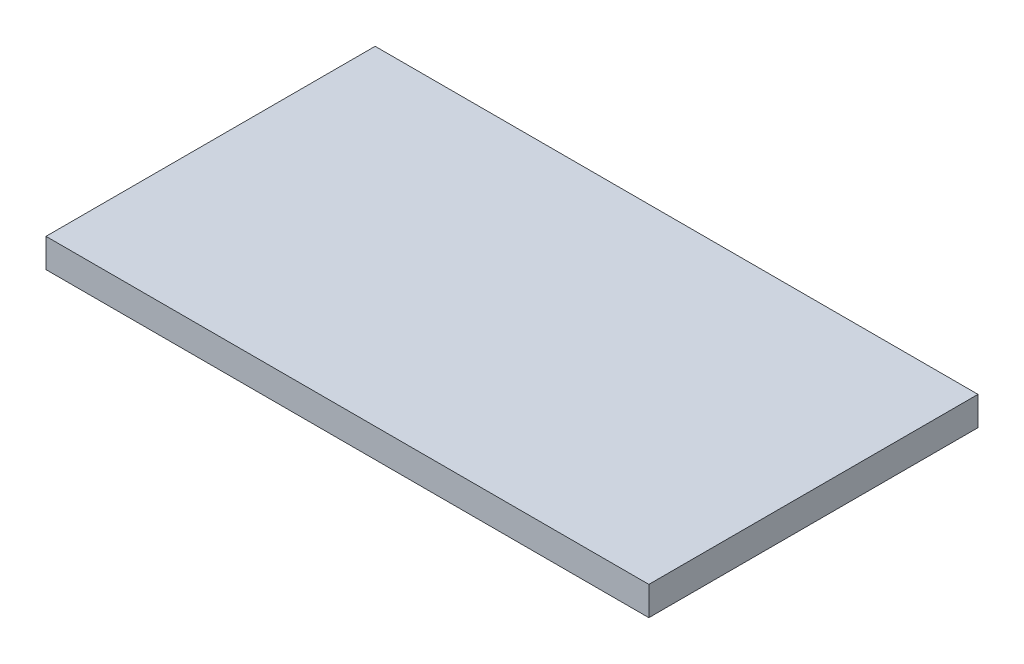
ISO-10303-21;
HEADER;
FILE_DESCRIPTION(('STEP AP214'),'2;1');
FILE_NAME('part.step','',(''),(''),'','','');
FILE_SCHEMA(('AUTOMOTIVE_DESIGN { 1 0 10303 214 1 1 1 1 }'));
ENDSEC;
DATA;
#1=APPLICATION_CONTEXT('core data for automotive mechanical design processes');
#2=APPLICATION_PROTOCOL_DEFINITION('international standard','automotive_design',2000,#1);
#3=PRODUCT_CONTEXT('',#1,'mechanical');
#4=PRODUCT('Part','Part','',(#3));
#5=PRODUCT_RELATED_PRODUCT_CATEGORY('part','',(#4));
#6=PRODUCT_DEFINITION_FORMATION('','',#4);
#7=PRODUCT_DEFINITION_CONTEXT('part definition',#1,'design');
#8=PRODUCT_DEFINITION('design','',#6,#7);
#9=PRODUCT_DEFINITION_SHAPE('','',#8);
#10=(LENGTH_UNIT() NAMED_UNIT(*) SI_UNIT(.MILLI.,.METRE.));
#11=(NAMED_UNIT(*) PLANE_ANGLE_UNIT() SI_UNIT($,.RADIAN.));
#12=(NAMED_UNIT(*) SI_UNIT($,.STERADIAN.) SOLID_ANGLE_UNIT());
#13=UNCERTAINTY_MEASURE_WITH_UNIT(LENGTH_MEASURE(1.E-05),#10,'distance_accuracy_value','');
#14=(GEOMETRIC_REPRESENTATION_CONTEXT(3) GLOBAL_UNCERTAINTY_ASSIGNED_CONTEXT((#13)) GLOBAL_UNIT_ASSIGNED_CONTEXT((#10,
#11,#12)) REPRESENTATION_CONTEXT('',''));
#15=CARTESIAN_POINT('',(0.,0.,0.));
#16=DIRECTION('',(0.,0.,1.));
#17=DIRECTION('',(1.,0.,0.));
#18=AXIS2_PLACEMENT_3D('',#15,#16,#17);
#19=CARTESIAN_POINT('',(0.,2.5,0.));
#20=DIRECTION('',(0.,-1.,0.));
#21=DIRECTION('',(0.,0.,-1.));
#22=AXIS2_PLACEMENT_3D('',#19,#20,#21);
#23=PLANE('',#22);
#24=DIRECTION('',(0.,0.,-1.));
#25=VECTOR('',#24,1.);
#26=CARTESIAN_POINT('',(26.1,2.5,11.7));
#27=LINE('',#26,#25);
#28=CARTESIAN_POINT('',(26.1,2.5,11.7));
#29=VERTEX_POINT('',#28);
#30=CARTESIAN_POINT('',(26.1,2.5,-16.8));
#31=VERTEX_POINT('',#30);
#32=EDGE_CURVE('E86',#29,#31,#27,.T.);
#33=ORIENTED_EDGE('',*,*,#32,.T.);
#34=DIRECTION('',(-1.,0.,0.));
#35=VECTOR('',#34,1.);
#36=CARTESIAN_POINT('',(-26.1,2.5,-16.8));
#37=LINE('',#36,#35);
#38=CARTESIAN_POINT('',(-26.1,2.5,-16.8));
#39=VERTEX_POINT('',#38);
#40=EDGE_CURVE('E82',#31,#39,#37,.T.);
#41=ORIENTED_EDGE('',*,*,#40,.T.);
#42=DIRECTION('',(0.,0.,1.));
#43=VECTOR('',#42,1.);
#44=CARTESIAN_POINT('',(-26.1,2.5,11.7));
#45=LINE('',#44,#43);
#46=CARTESIAN_POINT('',(-26.1,2.5,11.7));
#47=VERTEX_POINT('',#46);
#48=EDGE_CURVE('E84',#39,#47,#45,.T.);
#49=ORIENTED_EDGE('',*,*,#48,.T.);
#50=DIRECTION('',(1.,0.,0.));
#51=VECTOR('',#50,1.);
#52=CARTESIAN_POINT('',(-26.1,2.5,11.7));
#53=LINE('',#52,#51);
#54=EDGE_CURVE('E52',#47,#29,#53,.T.);
#55=ORIENTED_EDGE('',*,*,#54,.T.);
#56=EDGE_LOOP('',(#33,#41,#49,#55));
#57=FACE_BOUND('',#56,.T.);
#58=ADVANCED_FACE('F35',(#57),#23,.F.);
#59=CARTESIAN_POINT('',(0.,0.,0.));
#60=DIRECTION('',(0.,-1.,0.));
#61=DIRECTION('',(0.,0.,-1.));
#62=AXIS2_PLACEMENT_3D('',#59,#60,#61);
#63=PLANE('',#62);
#64=DIRECTION('',(0.,0.,-1.));
#65=VECTOR('',#64,1.);
#66=CARTESIAN_POINT('',(26.1,0.,11.7));
#67=LINE('',#66,#65);
#68=CARTESIAN_POINT('',(26.1,0.,11.7));
#69=VERTEX_POINT('',#68);
#70=CARTESIAN_POINT('',(26.1,0.,-16.8));
#71=VERTEX_POINT('',#70);
#72=EDGE_CURVE('E98',#69,#71,#67,.T.);
#73=ORIENTED_EDGE('',*,*,#72,.F.);
#74=DIRECTION('',(1.,0.,0.));
#75=VECTOR('',#74,1.);
#76=CARTESIAN_POINT('',(-26.1,0.,11.7));
#77=LINE('',#76,#75);
#78=CARTESIAN_POINT('',(-26.1,0.,11.7));
#79=VERTEX_POINT('',#78);
#80=EDGE_CURVE('E75',#79,#69,#77,.T.);
#81=ORIENTED_EDGE('',*,*,#80,.F.);
#82=DIRECTION('',(0.,0.,1.));
#83=VECTOR('',#82,1.);
#84=CARTESIAN_POINT('',(-26.1,0.,11.7));
#85=LINE('',#84,#83);
#86=CARTESIAN_POINT('',(-26.1,0.,-16.8));
#87=VERTEX_POINT('',#86);
#88=EDGE_CURVE('E69',#87,#79,#85,.T.);
#89=ORIENTED_EDGE('',*,*,#88,.F.);
#90=DIRECTION('',(-1.,0.,0.));
#91=VECTOR('',#90,1.);
#92=CARTESIAN_POINT('',(-26.1,0.,-16.8));
#93=LINE('',#92,#91);
#94=EDGE_CURVE('E90',#71,#87,#93,.T.);
#95=ORIENTED_EDGE('',*,*,#94,.F.);
#96=EDGE_LOOP('',(#73,#81,#89,#95));
#97=FACE_BOUND('',#96,.T.);
#98=ADVANCED_FACE('F108',(#97),#63,.T.);
#99=CARTESIAN_POINT('',(26.1,2.5,11.7));
#100=DIRECTION('',(-1.,0.,0.));
#101=DIRECTION('',(0.,0.,1.));
#102=AXIS2_PLACEMENT_3D('',#99,#100,#101);
#103=PLANE('',#102);
#104=ORIENTED_EDGE('',*,*,#72,.T.);
#105=DIRECTION('',(0.,-1.,0.));
#106=VECTOR('',#105,1.);
#107=CARTESIAN_POINT('',(26.1,2.5,-16.8));
#108=LINE('',#107,#106);
#109=EDGE_CURVE('E11',#31,#71,#108,.T.);
#110=ORIENTED_EDGE('',*,*,#109,.F.);
#111=ORIENTED_EDGE('',*,*,#32,.F.);
#112=DIRECTION('',(0.,-1.,0.));
#113=VECTOR('',#112,1.);
#114=CARTESIAN_POINT('',(26.1,2.5,11.7));
#115=LINE('',#114,#113);
#116=EDGE_CURVE('E94',#29,#69,#115,.T.);
#117=ORIENTED_EDGE('',*,*,#116,.T.);
#118=EDGE_LOOP('',(#104,#110,#111,#117));
#119=FACE_BOUND('',#118,.T.);
#120=ADVANCED_FACE('F37',(#119),#103,.F.);
#121=CARTESIAN_POINT('',(-26.1,2.5,-16.8));
#122=DIRECTION('',(0.,0.,1.));
#123=DIRECTION('',(1.,0.,0.));
#124=AXIS2_PLACEMENT_3D('',#121,#122,#123);
#125=PLANE('',#124);
#126=ORIENTED_EDGE('',*,*,#94,.T.);
#127=DIRECTION('',(0.,-1.,0.));
#128=VECTOR('',#127,1.);
#129=CARTESIAN_POINT('',(-26.1,2.5,-16.8));
#130=LINE('',#129,#128);
#131=EDGE_CURVE('E44',#39,#87,#130,.T.);
#132=ORIENTED_EDGE('',*,*,#131,.F.);
#133=ORIENTED_EDGE('',*,*,#40,.F.);
#134=ORIENTED_EDGE('',*,*,#109,.T.);
#135=EDGE_LOOP('',(#126,#132,#133,#134));
#136=FACE_BOUND('',#135,.T.);
#137=ADVANCED_FACE('F89',(#136),#125,.F.);
#138=CARTESIAN_POINT('',(-26.1,2.5,11.7));
#139=DIRECTION('',(1.,0.,0.));
#140=DIRECTION('',(0.,0.,-1.));
#141=AXIS2_PLACEMENT_3D('',#138,#139,#140);
#142=PLANE('',#141);
#143=ORIENTED_EDGE('',*,*,#88,.T.);
#144=DIRECTION('',(0.,-1.,0.));
#145=VECTOR('',#144,1.);
#146=CARTESIAN_POINT('',(-26.1,2.5,11.7));
#147=LINE('',#146,#145);
#148=EDGE_CURVE('E91',#47,#79,#147,.T.);
#149=ORIENTED_EDGE('',*,*,#148,.F.);
#150=ORIENTED_EDGE('',*,*,#48,.F.);
#151=ORIENTED_EDGE('',*,*,#131,.T.);
#152=EDGE_LOOP('',(#143,#149,#150,#151));
#153=FACE_BOUND('',#152,.T.);
#154=ADVANCED_FACE('F92',(#153),#142,.F.);
#155=CARTESIAN_POINT('',(-26.1,2.5,11.7));
#156=DIRECTION('',(0.,0.,-1.));
#157=DIRECTION('',(-1.,0.,0.));
#158=AXIS2_PLACEMENT_3D('',#155,#156,#157);
#159=PLANE('',#158);
#160=ORIENTED_EDGE('',*,*,#80,.T.);
#161=ORIENTED_EDGE('',*,*,#116,.F.);
#162=ORIENTED_EDGE('',*,*,#54,.F.);
#163=ORIENTED_EDGE('',*,*,#148,.T.);
#164=EDGE_LOOP('',(#160,#161,#162,#163));
#165=FACE_BOUND('',#164,.T.);
#166=ADVANCED_FACE('F105',(#165),#159,.F.);
#167=CLOSED_SHELL('',(#58,#98,#120,#137,#154,#166));
#168=MANIFOLD_SOLID_BREP('B2',#167);
#169=ADVANCED_BREP_SHAPE_REPRESENTATION('',(#18,#168),#14);
#170=SHAPE_DEFINITION_REPRESENTATION(#9,#169);
ENDSEC;
END-ISO-10303-21;
